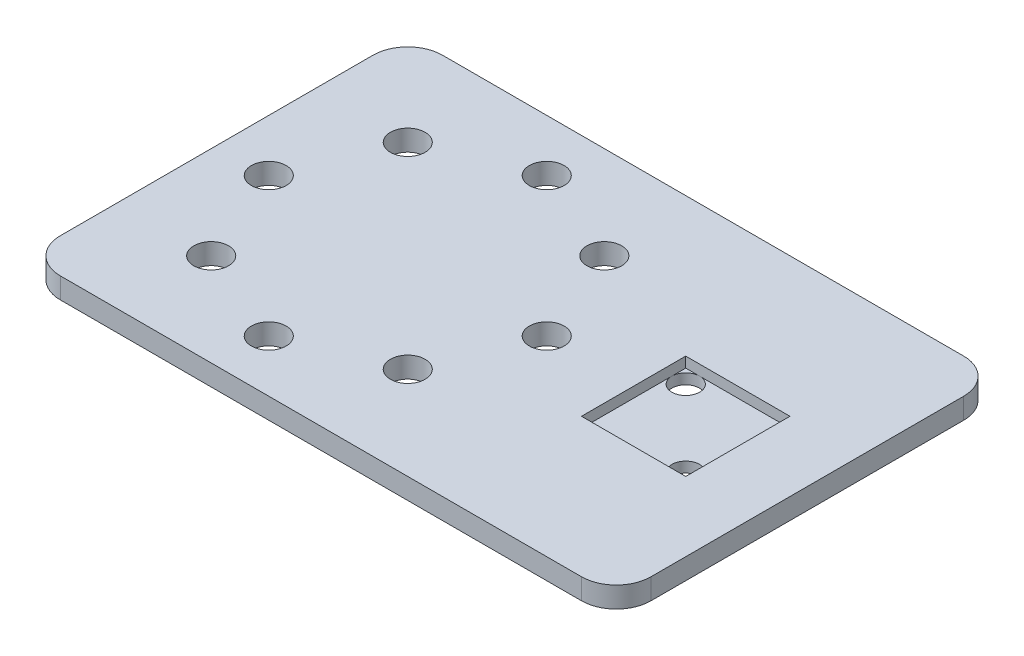
ISO-10303-21;
HEADER;
FILE_DESCRIPTION(('STEP AP214'),'2;1');
FILE_NAME('part.step','',(''),(''),'','','');
FILE_SCHEMA(('AUTOMOTIVE_DESIGN { 1 0 10303 214 1 1 1 1 }'));
ENDSEC;
DATA;
#1=APPLICATION_CONTEXT('core data for automotive mechanical design processes');
#2=APPLICATION_PROTOCOL_DEFINITION('international standard','automotive_design',2000,#1);
#3=PRODUCT_CONTEXT('',#1,'mechanical');
#4=PRODUCT('Part','Part','',(#3));
#5=PRODUCT_RELATED_PRODUCT_CATEGORY('part','',(#4));
#6=PRODUCT_DEFINITION_FORMATION('','',#4);
#7=PRODUCT_DEFINITION_CONTEXT('part definition',#1,'design');
#8=PRODUCT_DEFINITION('design','',#6,#7);
#9=PRODUCT_DEFINITION_SHAPE('','',#8);
#10=(LENGTH_UNIT() NAMED_UNIT(*) SI_UNIT(.MILLI.,.METRE.));
#11=(NAMED_UNIT(*) PLANE_ANGLE_UNIT() SI_UNIT($,.RADIAN.));
#12=(NAMED_UNIT(*) SI_UNIT($,.STERADIAN.) SOLID_ANGLE_UNIT());
#13=UNCERTAINTY_MEASURE_WITH_UNIT(LENGTH_MEASURE(1.E-05),#10,'distance_accuracy_value','');
#14=(GEOMETRIC_REPRESENTATION_CONTEXT(3) GLOBAL_UNCERTAINTY_ASSIGNED_CONTEXT((#13)) GLOBAL_UNIT_ASSIGNED_CONTEXT((#10,
#11,#12)) REPRESENTATION_CONTEXT('',''));
#15=CARTESIAN_POINT('',(0.,0.,0.));
#16=DIRECTION('',(0.,0.,1.));
#17=DIRECTION('',(1.,0.,0.));
#18=AXIS2_PLACEMENT_3D('',#15,#16,#17);
#19=CARTESIAN_POINT('',(42.502,1.5,-7.06673306772907));
#20=DIRECTION('',(0.,-1.,0.));
#21=DIRECTION('',(0.,0.,-1.));
#22=AXIS2_PLACEMENT_3D('',#19,#20,#21);
#23=PLANE('',#22);
#24=CARTESIAN_POINT('',(30.5,1.5,5.93326693227093));
#25=DIRECTION('',(0.,1.,0.));
#26=DIRECTION('',(0.,0.,1.));
#27=AXIS2_PLACEMENT_3D('',#24,#25,#26);
#28=CIRCLE('',#27,2.);
#29=CARTESIAN_POINT('',(30.5,1.5,7.93326693227093));
#30=VERTEX_POINT('',#29);
#31=CARTESIAN_POINT('',(32.5,1.5,5.93326693227093));
#32=VERTEX_POINT('',#31);
#33=EDGE_CURVE('E63',#30,#32,#28,.T.);
#34=ORIENTED_EDGE('',*,*,#33,.F.);
#35=DIRECTION('',(-1.,0.,0.));
#36=VECTOR('',#35,1.);
#37=CARTESIAN_POINT('',(42.502,1.5,7.93326693227093));
#38=LINE('',#37,#36);
#39=CARTESIAN_POINT('',(32.5,1.5,7.93326693227093));
#40=VERTEX_POINT('',#39);
#41=EDGE_CURVE('E175',#40,#30,#38,.T.);
#42=ORIENTED_EDGE('',*,*,#41,.F.);
#43=DIRECTION('',(0.,0.,-1.));
#44=VECTOR('',#43,1.);
#45=CARTESIAN_POINT('',(32.5,1.5,-7.06673306772907));
#46=LINE('',#45,#44);
#47=EDGE_CURVE('E166',#40,#32,#46,.T.);
#48=ORIENTED_EDGE('',*,*,#47,.T.);
#49=EDGE_LOOP('',(#34,#42,#48));
#50=FACE_BOUND('',#49,.T.);
#51=ADVANCED_FACE('F39',(#50),#23,.F.);
#52=CARTESIAN_POINT('',(19.5,1.5,-5.06673306772908));
#53=DIRECTION('',(0.,1.,0.));
#54=DIRECTION('',(0.,0.,1.));
#55=AXIS2_PLACEMENT_3D('',#52,#53,#54);
#56=CIRCLE('',#55,2.);
#57=CARTESIAN_POINT('',(19.5,1.5,-7.06673306772908));
#58=VERTEX_POINT('',#57);
#59=CARTESIAN_POINT('',(17.5,1.5,-5.06673306772908));
#60=VERTEX_POINT('',#59);
#61=EDGE_CURVE('E56',#58,#60,#56,.T.);
#62=ORIENTED_EDGE('',*,*,#61,.F.);
#63=DIRECTION('',(-1.,0.,0.));
#64=VECTOR('',#63,1.);
#65=CARTESIAN_POINT('',(42.502,1.5,-7.06673306772907));
#66=LINE('',#65,#64);
#67=CARTESIAN_POINT('',(17.5,1.5,-7.06673306772907));
#68=VERTEX_POINT('',#67);
#69=EDGE_CURVE('E152',#58,#68,#66,.T.);
#70=ORIENTED_EDGE('',*,*,#69,.T.);
#71=DIRECTION('',(0.,0.,1.));
#72=VECTOR('',#71,1.);
#73=CARTESIAN_POINT('',(17.5,1.5,-7.06673306772907));
#74=LINE('',#73,#72);
#75=EDGE_CURVE('E154',#68,#60,#74,.T.);
#76=ORIENTED_EDGE('',*,*,#75,.T.);
#77=EDGE_LOOP('',(#62,#70,#76));
#78=FACE_BOUND('',#77,.T.);
#79=ADVANCED_FACE('F151',(#78),#23,.F.);
#80=CARTESIAN_POINT('',(17.5,3.,7.93326693227093));
#81=DIRECTION('',(1.,0.,0.));
#82=DIRECTION('',(0.,0.,-1.));
#83=AXIS2_PLACEMENT_3D('',#80,#81,#82);
#84=PLANE('',#83);
#85=DIRECTION('',(0.,-1.,0.));
#86=VECTOR('',#85,1.);
#87=CARTESIAN_POINT('',(17.5,3.,7.93326693227093));
#88=LINE('',#87,#86);
#89=CARTESIAN_POINT('',(17.5,3.,7.93326693227093));
#90=VERTEX_POINT('',#89);
#91=CARTESIAN_POINT('',(17.5,1.5,7.93326693227093));
#92=VERTEX_POINT('',#91);
#93=EDGE_CURVE('E269',#90,#92,#88,.T.);
#94=ORIENTED_EDGE('',*,*,#93,.T.);
#95=EDGE_CURVE('E182',#60,#92,#74,.T.);
#96=ORIENTED_EDGE('',*,*,#95,.F.);
#97=ORIENTED_EDGE('',*,*,#75,.F.);
#98=DIRECTION('',(0.,-1.,0.));
#99=VECTOR('',#98,1.);
#100=CARTESIAN_POINT('',(17.5,3.,-7.06673306772907));
#101=LINE('',#100,#99);
#102=CARTESIAN_POINT('',(17.5,3.,-7.06673306772907));
#103=VERTEX_POINT('',#102);
#104=EDGE_CURVE('E164',#103,#68,#101,.T.);
#105=ORIENTED_EDGE('',*,*,#104,.F.);
#106=DIRECTION('',(0.,0.,1.));
#107=VECTOR('',#106,1.);
#108=CARTESIAN_POINT('',(17.5,3.,7.93326693227093));
#109=LINE('',#108,#107);
#110=EDGE_CURVE('E244',#103,#90,#109,.T.);
#111=ORIENTED_EDGE('',*,*,#110,.T.);
#112=EDGE_LOOP('',(#94,#96,#97,#105,#111));
#113=FACE_BOUND('',#112,.T.);
#114=ADVANCED_FACE('F381',(#113),#84,.T.);
#115=CARTESIAN_POINT('',(32.5,3.,7.93326693227092));
#116=DIRECTION('',(0.,0.,-1.));
#117=DIRECTION('',(-1.,0.,0.));
#118=AXIS2_PLACEMENT_3D('',#115,#116,#117);
#119=PLANE('',#118);
#120=DIRECTION('',(0.,-1.,0.));
#121=VECTOR('',#120,1.);
#122=CARTESIAN_POINT('',(32.5,3.,7.93326693227092));
#123=LINE('',#122,#121);
#124=CARTESIAN_POINT('',(32.5,3.,7.93326693227092));
#125=VERTEX_POINT('',#124);
#126=EDGE_CURVE('E265',#125,#40,#123,.T.);
#127=ORIENTED_EDGE('',*,*,#126,.T.);
#128=ORIENTED_EDGE('',*,*,#41,.T.);
#129=EDGE_CURVE('E172',#30,#92,#38,.T.);
#130=ORIENTED_EDGE('',*,*,#129,.T.);
#131=ORIENTED_EDGE('',*,*,#93,.F.);
#132=DIRECTION('',(1.,0.,0.));
#133=VECTOR('',#132,1.);
#134=CARTESIAN_POINT('',(32.5,3.,7.93326693227092));
#135=LINE('',#134,#133);
#136=EDGE_CURVE('E250',#90,#125,#135,.T.);
#137=ORIENTED_EDGE('',*,*,#136,.T.);
#138=EDGE_LOOP('',(#127,#128,#130,#131,#137));
#139=FACE_BOUND('',#138,.T.);
#140=ADVANCED_FACE('F372',(#139),#119,.T.);
#141=CARTESIAN_POINT('',(32.5,3.,7.93326693227092));
#142=DIRECTION('',(-1.,0.,0.));
#143=DIRECTION('',(0.,0.,1.));
#144=AXIS2_PLACEMENT_3D('',#141,#142,#143);
#145=PLANE('',#144);
#146=DIRECTION('',(0.,-1.,0.));
#147=VECTOR('',#146,1.);
#148=CARTESIAN_POINT('',(32.5,3.,-7.06673306772908));
#149=LINE('',#148,#147);
#150=CARTESIAN_POINT('',(32.5,3.,-7.06673306772908));
#151=VERTEX_POINT('',#150);
#152=CARTESIAN_POINT('',(32.5,1.5,-7.06673306772908));
#153=VERTEX_POINT('',#152);
#154=EDGE_CURVE('E262',#151,#153,#149,.T.);
#155=ORIENTED_EDGE('',*,*,#154,.T.);
#156=EDGE_CURVE('E170',#32,#153,#46,.T.);
#157=ORIENTED_EDGE('',*,*,#156,.F.);
#158=ORIENTED_EDGE('',*,*,#47,.F.);
#159=ORIENTED_EDGE('',*,*,#126,.F.);
#160=DIRECTION('',(0.,0.,-1.));
#161=VECTOR('',#160,1.);
#162=CARTESIAN_POINT('',(32.5,3.,7.93326693227092));
#163=LINE('',#162,#161);
#164=EDGE_CURVE('E253',#125,#151,#163,.T.);
#165=ORIENTED_EDGE('',*,*,#164,.T.);
#166=EDGE_LOOP('',(#155,#157,#158,#159,#165));
#167=FACE_BOUND('',#166,.T.);
#168=ADVANCED_FACE('F369',(#167),#145,.T.);
#169=CARTESIAN_POINT('',(32.5,3.,-7.06673306772908));
#170=DIRECTION('',(0.,0.,1.));
#171=DIRECTION('',(1.,0.,0.));
#172=AXIS2_PLACEMENT_3D('',#169,#170,#171);
#173=PLANE('',#172);
#174=ORIENTED_EDGE('',*,*,#104,.T.);
#175=ORIENTED_EDGE('',*,*,#69,.F.);
#176=EDGE_CURVE('E161',#153,#58,#66,.T.);
#177=ORIENTED_EDGE('',*,*,#176,.F.);
#178=ORIENTED_EDGE('',*,*,#154,.F.);
#179=DIRECTION('',(-1.,0.,0.));
#180=VECTOR('',#179,1.);
#181=CARTESIAN_POINT('',(32.5,3.,-7.06673306772908));
#182=LINE('',#181,#180);
#183=EDGE_CURVE('E257',#151,#103,#182,.T.);
#184=ORIENTED_EDGE('',*,*,#183,.T.);
#185=EDGE_LOOP('',(#174,#175,#177,#178,#184));
#186=FACE_BOUND('',#185,.T.);
#187=ADVANCED_FACE('F160',(#186),#173,.T.);
#188=CARTESIAN_POINT('',(0.,3.,0.));
#189=DIRECTION('',(0.,1.,0.));
#190=DIRECTION('',(0.,0.,1.));
#191=AXIS2_PLACEMENT_3D('',#188,#189,#190);
#192=PLANE('',#191);
#193=CARTESIAN_POINT('',(-15.0000000000002,3.,20.4332669322709));
#194=DIRECTION('',(0.,1.,0.));
#195=DIRECTION('',(0.,0.,1.));
#196=AXIS2_PLACEMENT_3D('',#193,#194,#195);
#197=CIRCLE('',#196,2.49999999999999);
#198=CARTESIAN_POINT('',(-15.0000000000002,3.,22.9332669322709));
#199=VERTEX_POINT('',#198);
#200=EDGE_CURVE('E192',#199,#199,#197,.T.);
#201=ORIENTED_EDGE('',*,*,#200,.F.);
#202=EDGE_LOOP('',(#201));
#203=FACE_BOUND('',#202,.T.);
#204=CARTESIAN_POINT('',(4.99999999999999,3.,0.433266932271059));
#205=DIRECTION('',(0.,1.,0.));
#206=DIRECTION('',(0.,0.,1.));
#207=AXIS2_PLACEMENT_3D('',#204,#205,#206);
#208=CIRCLE('',#207,2.49999999999999);
#209=CARTESIAN_POINT('',(4.99999999999999,3.,2.93326693227105));
#210=VERTEX_POINT('',#209);
#211=EDGE_CURVE('E208',#210,#210,#208,.T.);
#212=ORIENTED_EDGE('',*,*,#211,.F.);
#213=EDGE_LOOP('',(#212));
#214=FACE_BOUND('',#213,.T.);
#215=CARTESIAN_POINT('',(-14.9999999999999,3.,-19.5667330677291));
#216=DIRECTION('',(0.,1.,0.));
#217=DIRECTION('',(0.,0.,1.));
#218=AXIS2_PLACEMENT_3D('',#215,#216,#217);
#219=CIRCLE('',#218,2.49999999999999);
#220=CARTESIAN_POINT('',(-14.9999999999999,3.,-17.0667330677291));
#221=VERTEX_POINT('',#220);
#222=EDGE_CURVE('E224',#221,#221,#219,.T.);
#223=ORIENTED_EDGE('',*,*,#222,.F.);
#224=EDGE_LOOP('',(#223));
#225=FACE_BOUND('',#224,.T.);
#226=CARTESIAN_POINT('',(-35.,3.,0.433266932270919));
#227=DIRECTION('',(0.,1.,0.));
#228=DIRECTION('',(0.,0.,1.));
#229=AXIS2_PLACEMENT_3D('',#226,#227,#228);
#230=CIRCLE('',#229,2.49999999999999);
#231=CARTESIAN_POINT('',(-35.,3.,2.93326693227091));
#232=VERTEX_POINT('',#231);
#233=EDGE_CURVE('E240',#232,#232,#230,.T.);
#234=ORIENTED_EDGE('',*,*,#233,.F.);
#235=EDGE_LOOP('',(#234));
#236=FACE_BOUND('',#235,.T.);
#237=DIRECTION('',(0.,0.,-1.));
#238=VECTOR('',#237,1.);
#239=CARTESIAN_POINT('',(42.5,3.,27.9332669322709));
#240=LINE('',#239,#238);
#241=CARTESIAN_POINT('',(42.5,3.,22.9332669322709));
#242=VERTEX_POINT('',#241);
#243=CARTESIAN_POINT('',(42.5,3.,-22.0667330677291));
#244=VERTEX_POINT('',#243);
#245=EDGE_CURVE('E274',#242,#244,#240,.T.);
#246=ORIENTED_EDGE('',*,*,#245,.T.);
#247=CARTESIAN_POINT('',(37.5,3.,-22.0667330677291));
#248=DIRECTION('',(0.,1.,0.));
#249=DIRECTION('',(0.,0.,1.));
#250=AXIS2_PLACEMENT_3D('',#247,#248,#249);
#251=CIRCLE('',#250,5.);
#252=CARTESIAN_POINT('',(37.5,3.,-27.0667330677291));
#253=VERTEX_POINT('',#252);
#254=EDGE_CURVE('E340',#244,#253,#251,.T.);
#255=ORIENTED_EDGE('',*,*,#254,.T.);
#256=DIRECTION('',(-1.,0.,0.));
#257=VECTOR('',#256,1.);
#258=CARTESIAN_POINT('',(42.5,3.,-27.0667330677291));
#259=LINE('',#258,#257);
#260=CARTESIAN_POINT('',(-37.5,3.,-27.0667330677291));
#261=VERTEX_POINT('',#260);
#262=EDGE_CURVE('E278',#253,#261,#259,.T.);
#263=ORIENTED_EDGE('',*,*,#262,.T.);
#264=CARTESIAN_POINT('',(-37.5,3.,-22.0667330677291));
#265=DIRECTION('',(0.,1.,0.));
#266=DIRECTION('',(0.,0.,1.));
#267=AXIS2_PLACEMENT_3D('',#264,#265,#266);
#268=CIRCLE('',#267,5.);
#269=CARTESIAN_POINT('',(-42.5,3.,-22.0667330677291));
#270=VERTEX_POINT('',#269);
#271=EDGE_CURVE('E337',#261,#270,#268,.T.);
#272=ORIENTED_EDGE('',*,*,#271,.T.);
#273=DIRECTION('',(0.,0.,1.));
#274=VECTOR('',#273,1.);
#275=CARTESIAN_POINT('',(-42.5,3.,27.9332669322709));
#276=LINE('',#275,#274);
#277=CARTESIAN_POINT('',(-42.5,3.,22.9332669322709));
#278=VERTEX_POINT('',#277);
#279=EDGE_CURVE('E283',#270,#278,#276,.T.);
#280=ORIENTED_EDGE('',*,*,#279,.T.);
#281=CARTESIAN_POINT('',(-37.5,3.,22.9332669322709));
#282=DIRECTION('',(0.,1.,0.));
#283=DIRECTION('',(0.,0.,1.));
#284=AXIS2_PLACEMENT_3D('',#281,#282,#283);
#285=CIRCLE('',#284,5.);
#286=CARTESIAN_POINT('',(-37.5,3.,27.9332669322709));
#287=VERTEX_POINT('',#286);
#288=EDGE_CURVE('E334',#278,#287,#285,.T.);
#289=ORIENTED_EDGE('',*,*,#288,.T.);
#290=DIRECTION('',(1.,0.,0.));
#291=VECTOR('',#290,1.);
#292=CARTESIAN_POINT('',(42.5,3.,27.9332669322709));
#293=LINE('',#292,#291);
#294=CARTESIAN_POINT('',(37.5,3.,27.9332669322709));
#295=VERTEX_POINT('',#294);
#296=EDGE_CURVE('E287',#287,#295,#293,.T.);
#297=ORIENTED_EDGE('',*,*,#296,.T.);
#298=CARTESIAN_POINT('',(37.5,3.,22.9332669322709));
#299=DIRECTION('',(0.,1.,0.));
#300=DIRECTION('',(0.,0.,1.));
#301=AXIS2_PLACEMENT_3D('',#298,#299,#300);
#302=CIRCLE('',#301,5.);
#303=EDGE_CURVE('E331',#295,#242,#302,.T.);
#304=ORIENTED_EDGE('',*,*,#303,.T.);
#305=EDGE_LOOP('',(#246,#255,#263,#272,#280,#289,#297,#304));
#306=FACE_BOUND('',#305,.T.);
#307=ORIENTED_EDGE('',*,*,#136,.F.);
#308=ORIENTED_EDGE('',*,*,#110,.F.);
#309=ORIENTED_EDGE('',*,*,#183,.F.);
#310=ORIENTED_EDGE('',*,*,#164,.F.);
#311=EDGE_LOOP('',(#307,#308,#309,#310));
#312=FACE_BOUND('',#311,.T.);
#313=CARTESIAN_POINT('',(-29.1421356237309,3.,-13.7088686914601));
#314=DIRECTION('',(0.,1.,0.));
#315=DIRECTION('',(0.,0.,1.));
#316=AXIS2_PLACEMENT_3D('',#313,#314,#315);
#317=CIRCLE('',#316,2.5);
#318=CARTESIAN_POINT('',(-29.1421356237309,3.,-11.2088686914601));
#319=VERTEX_POINT('',#318);
#320=EDGE_CURVE('E232',#319,#319,#317,.T.);
#321=ORIENTED_EDGE('',*,*,#320,.F.);
#322=EDGE_LOOP('',(#321));
#323=FACE_BOUND('',#322,.T.);
#324=CARTESIAN_POINT('',(-0.857864376268978,3.,-13.7088686914599));
#325=DIRECTION('',(0.,1.,0.));
#326=DIRECTION('',(0.,0.,1.));
#327=AXIS2_PLACEMENT_3D('',#324,#325,#326);
#328=CIRCLE('',#327,2.49999999999999);
#329=CARTESIAN_POINT('',(-0.857864376268978,3.,-11.20886869146));
#330=VERTEX_POINT('',#329);
#331=EDGE_CURVE('E216',#330,#330,#328,.T.);
#332=ORIENTED_EDGE('',*,*,#331,.F.);
#333=EDGE_LOOP('',(#332));
#334=FACE_BOUND('',#333,.T.);
#335=CARTESIAN_POINT('',(-0.857864376269179,3.,14.575402556002));
#336=DIRECTION('',(0.,1.,0.));
#337=DIRECTION('',(0.,0.,1.));
#338=AXIS2_PLACEMENT_3D('',#335,#336,#337);
#339=CIRCLE('',#338,2.49999999999999);
#340=CARTESIAN_POINT('',(-0.857864376269179,3.,17.075402556002));
#341=VERTEX_POINT('',#340);
#342=EDGE_CURVE('E200',#341,#341,#339,.T.);
#343=ORIENTED_EDGE('',*,*,#342,.F.);
#344=EDGE_LOOP('',(#343));
#345=FACE_BOUND('',#344,.T.);
#346=CARTESIAN_POINT('',(-29.1421356237311,3.,14.5754025560017));
#347=DIRECTION('',(0.,1.,0.));
#348=DIRECTION('',(0.,0.,1.));
#349=AXIS2_PLACEMENT_3D('',#346,#347,#348);
#350=CIRCLE('',#349,2.5);
#351=CARTESIAN_POINT('',(-29.1421356237311,3.,17.0754025560017));
#352=VERTEX_POINT('',#351);
#353=EDGE_CURVE('E183',#352,#352,#350,.T.);
#354=ORIENTED_EDGE('',*,*,#353,.F.);
#355=EDGE_LOOP('',(#354));
#356=FACE_BOUND('',#355,.T.);
#357=ADVANCED_FACE('F377',(#203,#214,#225,#236,#306,#312,#323,#334,#345,#356),#192,.T.);
#358=CARTESIAN_POINT('',(0.,0.,0.));
#359=DIRECTION('',(0.,1.,0.));
#360=DIRECTION('',(0.,0.,1.));
#361=AXIS2_PLACEMENT_3D('',#358,#359,#360);
#362=PLANE('',#361);
#363=CARTESIAN_POINT('',(30.5,0.,5.93326693227093));
#364=DIRECTION('',(0.,1.,0.));
#365=DIRECTION('',(0.,0.,1.));
#366=AXIS2_PLACEMENT_3D('',#363,#364,#365);
#367=CIRCLE('',#366,2.);
#368=CARTESIAN_POINT('',(30.5,0.,7.93326693227093));
#369=VERTEX_POINT('',#368);
#370=EDGE_CURVE('E43',#369,#369,#367,.T.);
#371=ORIENTED_EDGE('',*,*,#370,.T.);
#372=EDGE_LOOP('',(#371));
#373=FACE_BOUND('',#372,.T.);
#374=CARTESIAN_POINT('',(19.5,0.,-5.06673306772908));
#375=DIRECTION('',(0.,1.,0.));
#376=DIRECTION('',(0.,0.,1.));
#377=AXIS2_PLACEMENT_3D('',#374,#375,#376);
#378=CIRCLE('',#377,2.);
#379=CARTESIAN_POINT('',(19.5,0.,-3.06673306772907));
#380=VERTEX_POINT('',#379);
#381=EDGE_CURVE('E351',#380,#380,#378,.T.);
#382=ORIENTED_EDGE('',*,*,#381,.T.);
#383=EDGE_LOOP('',(#382));
#384=FACE_BOUND('',#383,.T.);
#385=DIRECTION('',(-1.,0.,0.));
#386=VECTOR('',#385,1.);
#387=CARTESIAN_POINT('',(42.5,0.,-27.0667330677291));
#388=LINE('',#387,#386);
#389=CARTESIAN_POINT('',(37.5,0.,-27.0667330677291));
#390=VERTEX_POINT('',#389);
#391=CARTESIAN_POINT('',(-37.5,0.,-27.0667330677291));
#392=VERTEX_POINT('',#391);
#393=EDGE_CURVE('E295',#390,#392,#388,.T.);
#394=ORIENTED_EDGE('',*,*,#393,.F.);
#395=CARTESIAN_POINT('',(37.5,0.,-22.0667330677291));
#396=DIRECTION('',(0.,1.,0.));
#397=DIRECTION('',(0.,0.,1.));
#398=AXIS2_PLACEMENT_3D('',#395,#396,#397);
#399=CIRCLE('',#398,5.);
#400=CARTESIAN_POINT('',(42.5,0.,-22.0667330677291));
#401=VERTEX_POINT('',#400);
#402=EDGE_CURVE('E321',#390,#401,#399,.F.);
#403=ORIENTED_EDGE('',*,*,#402,.T.);
#404=DIRECTION('',(0.,0.,-1.));
#405=VECTOR('',#404,1.);
#406=CARTESIAN_POINT('',(42.5,0.,27.9332669322709));
#407=LINE('',#406,#405);
#408=CARTESIAN_POINT('',(42.5,0.,22.9332669322709));
#409=VERTEX_POINT('',#408);
#410=EDGE_CURVE('E273',#409,#401,#407,.T.);
#411=ORIENTED_EDGE('',*,*,#410,.F.);
#412=CARTESIAN_POINT('',(37.5,0.,22.9332669322709));
#413=DIRECTION('',(0.,1.,0.));
#414=DIRECTION('',(0.,0.,1.));
#415=AXIS2_PLACEMENT_3D('',#412,#413,#414);
#416=CIRCLE('',#415,5.);
#417=CARTESIAN_POINT('',(37.5,0.,27.9332669322709));
#418=VERTEX_POINT('',#417);
#419=EDGE_CURVE('E312',#409,#418,#416,.F.);
#420=ORIENTED_EDGE('',*,*,#419,.T.);
#421=DIRECTION('',(1.,0.,0.));
#422=VECTOR('',#421,1.);
#423=CARTESIAN_POINT('',(42.5,0.,27.9332669322709));
#424=LINE('',#423,#422);
#425=CARTESIAN_POINT('',(-37.5,0.,27.9332669322709));
#426=VERTEX_POINT('',#425);
#427=EDGE_CURVE('E279',#426,#418,#424,.T.);
#428=ORIENTED_EDGE('',*,*,#427,.F.);
#429=CARTESIAN_POINT('',(-37.5,0.,22.9332669322709));
#430=DIRECTION('',(0.,1.,0.));
#431=DIRECTION('',(0.,0.,1.));
#432=AXIS2_PLACEMENT_3D('',#429,#430,#431);
#433=CIRCLE('',#432,5.);
#434=CARTESIAN_POINT('',(-42.5,0.,22.9332669322709));
#435=VERTEX_POINT('',#434);
#436=EDGE_CURVE('E315',#426,#435,#433,.F.);
#437=ORIENTED_EDGE('',*,*,#436,.T.);
#438=DIRECTION('',(0.,0.,1.));
#439=VECTOR('',#438,1.);
#440=CARTESIAN_POINT('',(-42.5,0.,27.9332669322709));
#441=LINE('',#440,#439);
#442=CARTESIAN_POINT('',(-42.5,0.,-22.0667330677291));
#443=VERTEX_POINT('',#442);
#444=EDGE_CURVE('E299',#443,#435,#441,.T.);
#445=ORIENTED_EDGE('',*,*,#444,.F.);
#446=CARTESIAN_POINT('',(-37.5,0.,-22.0667330677291));
#447=DIRECTION('',(0.,1.,0.));
#448=DIRECTION('',(0.,0.,1.));
#449=AXIS2_PLACEMENT_3D('',#446,#447,#448);
#450=CIRCLE('',#449,5.);
#451=EDGE_CURVE('E318',#443,#392,#450,.F.);
#452=ORIENTED_EDGE('',*,*,#451,.T.);
#453=EDGE_LOOP('',(#394,#403,#411,#420,#428,#437,#445,#452));
#454=FACE_BOUND('',#453,.T.);
#455=CARTESIAN_POINT('',(-35.,0.,0.433266932270919));
#456=DIRECTION('',(0.,1.,0.));
#457=DIRECTION('',(0.,0.,1.));
#458=AXIS2_PLACEMENT_3D('',#455,#456,#457);
#459=CIRCLE('',#458,2.49999999999999);
#460=CARTESIAN_POINT('',(-35.,0.,2.93326693227091));
#461=VERTEX_POINT('',#460);
#462=EDGE_CURVE('E236',#461,#461,#459,.T.);
#463=ORIENTED_EDGE('',*,*,#462,.T.);
#464=EDGE_LOOP('',(#463));
#465=FACE_BOUND('',#464,.T.);
#466=CARTESIAN_POINT('',(-29.1421356237309,0.,-13.7088686914601));
#467=DIRECTION('',(0.,1.,0.));
#468=DIRECTION('',(0.,0.,1.));
#469=AXIS2_PLACEMENT_3D('',#466,#467,#468);
#470=CIRCLE('',#469,2.5);
#471=CARTESIAN_POINT('',(-29.1421356237309,0.,-11.2088686914601));
#472=VERTEX_POINT('',#471);
#473=EDGE_CURVE('E228',#472,#472,#470,.T.);
#474=ORIENTED_EDGE('',*,*,#473,.T.);
#475=EDGE_LOOP('',(#474));
#476=FACE_BOUND('',#475,.T.);
#477=CARTESIAN_POINT('',(-14.9999999999999,0.,-19.5667330677291));
#478=DIRECTION('',(0.,1.,0.));
#479=DIRECTION('',(0.,0.,1.));
#480=AXIS2_PLACEMENT_3D('',#477,#478,#479);
#481=CIRCLE('',#480,2.49999999999999);
#482=CARTESIAN_POINT('',(-14.9999999999999,0.,-17.0667330677291));
#483=VERTEX_POINT('',#482);
#484=EDGE_CURVE('E220',#483,#483,#481,.T.);
#485=ORIENTED_EDGE('',*,*,#484,.T.);
#486=EDGE_LOOP('',(#485));
#487=FACE_BOUND('',#486,.T.);
#488=CARTESIAN_POINT('',(-0.857864376268978,0.,-13.7088686914599));
#489=DIRECTION('',(0.,1.,0.));
#490=DIRECTION('',(0.,0.,1.));
#491=AXIS2_PLACEMENT_3D('',#488,#489,#490);
#492=CIRCLE('',#491,2.49999999999999);
#493=CARTESIAN_POINT('',(-0.857864376268978,0.,-11.20886869146));
#494=VERTEX_POINT('',#493);
#495=EDGE_CURVE('E212',#494,#494,#492,.T.);
#496=ORIENTED_EDGE('',*,*,#495,.T.);
#497=EDGE_LOOP('',(#496));
#498=FACE_BOUND('',#497,.T.);
#499=CARTESIAN_POINT('',(4.99999999999999,0.,0.433266932271059));
#500=DIRECTION('',(0.,1.,0.));
#501=DIRECTION('',(0.,0.,1.));
#502=AXIS2_PLACEMENT_3D('',#499,#500,#501);
#503=CIRCLE('',#502,2.49999999999999);
#504=CARTESIAN_POINT('',(4.99999999999999,0.,2.93326693227105));
#505=VERTEX_POINT('',#504);
#506=EDGE_CURVE('E204',#505,#505,#503,.T.);
#507=ORIENTED_EDGE('',*,*,#506,.T.);
#508=EDGE_LOOP('',(#507));
#509=FACE_BOUND('',#508,.T.);
#510=CARTESIAN_POINT('',(-0.857864376269179,0.,14.575402556002));
#511=DIRECTION('',(0.,1.,0.));
#512=DIRECTION('',(0.,0.,1.));
#513=AXIS2_PLACEMENT_3D('',#510,#511,#512);
#514=CIRCLE('',#513,2.49999999999999);
#515=CARTESIAN_POINT('',(-0.857864376269179,0.,17.075402556002));
#516=VERTEX_POINT('',#515);
#517=EDGE_CURVE('E196',#516,#516,#514,.T.);
#518=ORIENTED_EDGE('',*,*,#517,.T.);
#519=EDGE_LOOP('',(#518));
#520=FACE_BOUND('',#519,.T.);
#521=CARTESIAN_POINT('',(-15.0000000000002,0.,20.4332669322709));
#522=DIRECTION('',(0.,1.,0.));
#523=DIRECTION('',(0.,0.,1.));
#524=AXIS2_PLACEMENT_3D('',#521,#522,#523);
#525=CIRCLE('',#524,2.49999999999999);
#526=CARTESIAN_POINT('',(-15.0000000000002,0.,22.9332669322709));
#527=VERTEX_POINT('',#526);
#528=EDGE_CURVE('E187',#527,#527,#525,.T.);
#529=ORIENTED_EDGE('',*,*,#528,.T.);
#530=EDGE_LOOP('',(#529));
#531=FACE_BOUND('',#530,.T.);
#532=CARTESIAN_POINT('',(-29.1421356237311,0.,14.5754025560017));
#533=DIRECTION('',(0.,1.,0.));
#534=DIRECTION('',(0.,0.,1.));
#535=AXIS2_PLACEMENT_3D('',#532,#533,#534);
#536=CIRCLE('',#535,2.5);
#537=CARTESIAN_POINT('',(-29.1421356237311,0.,17.0754025560017));
#538=VERTEX_POINT('',#537);
#539=EDGE_CURVE('E188',#538,#538,#536,.T.);
#540=ORIENTED_EDGE('',*,*,#539,.T.);
#541=EDGE_LOOP('',(#540));
#542=FACE_BOUND('',#541,.T.);
#543=ADVANCED_FACE('F390',(#373,#384,#454,#465,#476,#487,#498,#509,#520,#531,#542),#362,.F.);
#544=CARTESIAN_POINT('',(42.5,3.,27.9332669322709));
#545=DIRECTION('',(-1.,0.,0.));
#546=DIRECTION('',(0.,0.,1.));
#547=AXIS2_PLACEMENT_3D('',#544,#545,#546);
#548=PLANE('',#547);
#549=ORIENTED_EDGE('',*,*,#410,.T.);
#550=DIRECTION('',(0.,-1.,0.));
#551=VECTOR('',#550,1.);
#552=CARTESIAN_POINT('',(42.5,3.,-22.0667330677291));
#553=LINE('',#552,#551);
#554=EDGE_CURVE('E328',#401,#244,#553,.F.);
#555=ORIENTED_EDGE('',*,*,#554,.T.);
#556=ORIENTED_EDGE('',*,*,#245,.F.);
#557=DIRECTION('',(0.,-1.,0.));
#558=VECTOR('',#557,1.);
#559=CARTESIAN_POINT('',(42.5,3.,22.9332669322709));
#560=LINE('',#559,#558);
#561=EDGE_CURVE('E324',#242,#409,#560,.T.);
#562=ORIENTED_EDGE('',*,*,#561,.T.);
#563=EDGE_LOOP('',(#549,#555,#556,#562));
#564=FACE_BOUND('',#563,.T.);
#565=ADVANCED_FACE('F392',(#564),#548,.F.);
#566=CARTESIAN_POINT('',(42.5,3.,-27.0667330677291));
#567=DIRECTION('',(0.,0.,1.));
#568=DIRECTION('',(1.,0.,0.));
#569=AXIS2_PLACEMENT_3D('',#566,#567,#568);
#570=PLANE('',#569);
#571=ORIENTED_EDGE('',*,*,#262,.F.);
#572=DIRECTION('',(0.,-1.,0.));
#573=VECTOR('',#572,1.);
#574=CARTESIAN_POINT('',(37.5,3.,-27.0667330677291));
#575=LINE('',#574,#573);
#576=EDGE_CURVE('E308',#253,#390,#575,.T.);
#577=ORIENTED_EDGE('',*,*,#576,.T.);
#578=ORIENTED_EDGE('',*,*,#393,.T.);
#579=DIRECTION('',(0.,-1.,0.));
#580=VECTOR('',#579,1.);
#581=CARTESIAN_POINT('',(-37.5,3.,-27.0667330677291));
#582=LINE('',#581,#580);
#583=EDGE_CURVE('E291',#392,#261,#582,.F.);
#584=ORIENTED_EDGE('',*,*,#583,.T.);
#585=EDGE_LOOP('',(#571,#577,#578,#584));
#586=FACE_BOUND('',#585,.T.);
#587=ADVANCED_FACE('F460',(#586),#570,.F.);
#588=CARTESIAN_POINT('',(-42.5,3.,27.9332669322709));
#589=DIRECTION('',(1.,0.,0.));
#590=DIRECTION('',(0.,0.,-1.));
#591=AXIS2_PLACEMENT_3D('',#588,#589,#590);
#592=PLANE('',#591);
#593=ORIENTED_EDGE('',*,*,#279,.F.);
#594=DIRECTION('',(0.,-1.,0.));
#595=VECTOR('',#594,1.);
#596=CARTESIAN_POINT('',(-42.5,3.,-22.0667330677291));
#597=LINE('',#596,#595);
#598=EDGE_CURVE('E346',#270,#443,#597,.T.);
#599=ORIENTED_EDGE('',*,*,#598,.T.);
#600=ORIENTED_EDGE('',*,*,#444,.T.);
#601=DIRECTION('',(0.,-1.,0.));
#602=VECTOR('',#601,1.);
#603=CARTESIAN_POINT('',(-42.5,3.,22.9332669322709));
#604=LINE('',#603,#602);
#605=EDGE_CURVE('E343',#435,#278,#604,.F.);
#606=ORIENTED_EDGE('',*,*,#605,.T.);
#607=EDGE_LOOP('',(#593,#599,#600,#606));
#608=FACE_BOUND('',#607,.T.);
#609=ADVANCED_FACE('F467',(#608),#592,.F.);
#610=CARTESIAN_POINT('',(42.5,3.,27.9332669322709));
#611=DIRECTION('',(0.,0.,-1.));
#612=DIRECTION('',(-1.,0.,0.));
#613=AXIS2_PLACEMENT_3D('',#610,#611,#612);
#614=PLANE('',#613);
#615=ORIENTED_EDGE('',*,*,#296,.F.);
#616=DIRECTION('',(0.,-1.,0.));
#617=VECTOR('',#616,1.);
#618=CARTESIAN_POINT('',(-37.5,3.,27.9332669322709));
#619=LINE('',#618,#617);
#620=EDGE_CURVE('E11',#287,#426,#619,.T.);
#621=ORIENTED_EDGE('',*,*,#620,.T.);
#622=ORIENTED_EDGE('',*,*,#427,.T.);
#623=DIRECTION('',(0.,-1.,0.));
#624=VECTOR('',#623,1.);
#625=CARTESIAN_POINT('',(37.5,3.,27.9332669322709));
#626=LINE('',#625,#624);
#627=EDGE_CURVE('E49',#418,#295,#626,.F.);
#628=ORIENTED_EDGE('',*,*,#627,.T.);
#629=EDGE_LOOP('',(#615,#621,#622,#628));
#630=FACE_BOUND('',#629,.T.);
#631=ADVANCED_FACE('F472',(#630),#614,.F.);
#632=CARTESIAN_POINT('',(-35.,3.,0.433266932270919));
#633=DIRECTION('',(0.,-1.,0.));
#634=DIRECTION('',(0.,0.,-1.));
#635=AXIS2_PLACEMENT_3D('',#632,#633,#634);
#636=CYLINDRICAL_SURFACE('',#635,2.49999999999999);
#637=ORIENTED_EDGE('',*,*,#233,.T.);
#638=EDGE_LOOP('',(#637));
#639=FACE_BOUND('',#638,.T.);
#640=ORIENTED_EDGE('',*,*,#462,.F.);
#641=EDGE_LOOP('',(#640));
#642=FACE_BOUND('',#641,.T.);
#643=ADVANCED_FACE('F475',(#639,#642),#636,.F.);
#644=CARTESIAN_POINT('',(-29.1421356237309,3.,-13.7088686914601));
#645=DIRECTION('',(0.,-1.,0.));
#646=DIRECTION('',(0.,0.,-1.));
#647=AXIS2_PLACEMENT_3D('',#644,#645,#646);
#648=CYLINDRICAL_SURFACE('',#647,2.5);
#649=ORIENTED_EDGE('',*,*,#320,.T.);
#650=EDGE_LOOP('',(#649));
#651=FACE_BOUND('',#650,.T.);
#652=ORIENTED_EDGE('',*,*,#473,.F.);
#653=EDGE_LOOP('',(#652));
#654=FACE_BOUND('',#653,.T.);
#655=ADVANCED_FACE('F481',(#651,#654),#648,.F.);
#656=CARTESIAN_POINT('',(-14.9999999999999,3.,-19.5667330677291));
#657=DIRECTION('',(0.,-1.,0.));
#658=DIRECTION('',(0.,0.,-1.));
#659=AXIS2_PLACEMENT_3D('',#656,#657,#658);
#660=CYLINDRICAL_SURFACE('',#659,2.49999999999999);
#661=ORIENTED_EDGE('',*,*,#222,.T.);
#662=EDGE_LOOP('',(#661));
#663=FACE_BOUND('',#662,.T.);
#664=ORIENTED_EDGE('',*,*,#484,.F.);
#665=EDGE_LOOP('',(#664));
#666=FACE_BOUND('',#665,.T.);
#667=ADVANCED_FACE('F634',(#663,#666),#660,.F.);
#668=CARTESIAN_POINT('',(-0.857864376268978,3.,-13.7088686914599));
#669=DIRECTION('',(0.,-1.,0.));
#670=DIRECTION('',(0.,0.,-1.));
#671=AXIS2_PLACEMENT_3D('',#668,#669,#670);
#672=CYLINDRICAL_SURFACE('',#671,2.49999999999999);
#673=ORIENTED_EDGE('',*,*,#331,.T.);
#674=EDGE_LOOP('',(#673));
#675=FACE_BOUND('',#674,.T.);
#676=ORIENTED_EDGE('',*,*,#495,.F.);
#677=EDGE_LOOP('',(#676));
#678=FACE_BOUND('',#677,.T.);
#679=ADVANCED_FACE('F625',(#675,#678),#672,.F.);
#680=CARTESIAN_POINT('',(4.99999999999999,3.,0.433266932271059));
#681=DIRECTION('',(0.,-1.,0.));
#682=DIRECTION('',(0.,0.,-1.));
#683=AXIS2_PLACEMENT_3D('',#680,#681,#682);
#684=CYLINDRICAL_SURFACE('',#683,2.49999999999999);
#685=ORIENTED_EDGE('',*,*,#211,.T.);
#686=EDGE_LOOP('',(#685));
#687=FACE_BOUND('',#686,.T.);
#688=ORIENTED_EDGE('',*,*,#506,.F.);
#689=EDGE_LOOP('',(#688));
#690=FACE_BOUND('',#689,.T.);
#691=ADVANCED_FACE('F616',(#687,#690),#684,.F.);
#692=CARTESIAN_POINT('',(-0.857864376269179,3.,14.575402556002));
#693=DIRECTION('',(0.,-1.,0.));
#694=DIRECTION('',(0.,0.,-1.));
#695=AXIS2_PLACEMENT_3D('',#692,#693,#694);
#696=CYLINDRICAL_SURFACE('',#695,2.49999999999999);
#697=ORIENTED_EDGE('',*,*,#342,.T.);
#698=EDGE_LOOP('',(#697));
#699=FACE_BOUND('',#698,.T.);
#700=ORIENTED_EDGE('',*,*,#517,.F.);
#701=EDGE_LOOP('',(#700));
#702=FACE_BOUND('',#701,.T.);
#703=ADVANCED_FACE('F426',(#699,#702),#696,.F.);
#704=CARTESIAN_POINT('',(-15.0000000000002,3.,20.4332669322709));
#705=DIRECTION('',(0.,-1.,0.));
#706=DIRECTION('',(0.,0.,-1.));
#707=AXIS2_PLACEMENT_3D('',#704,#705,#706);
#708=CYLINDRICAL_SURFACE('',#707,2.49999999999999);
#709=ORIENTED_EDGE('',*,*,#200,.T.);
#710=EDGE_LOOP('',(#709));
#711=FACE_BOUND('',#710,.T.);
#712=ORIENTED_EDGE('',*,*,#528,.F.);
#713=EDGE_LOOP('',(#712));
#714=FACE_BOUND('',#713,.T.);
#715=ADVANCED_FACE('F416',(#711,#714),#708,.F.);
#716=CARTESIAN_POINT('',(-29.1421356237311,3.,14.5754025560017));
#717=DIRECTION('',(0.,-1.,0.));
#718=DIRECTION('',(0.,0.,-1.));
#719=AXIS2_PLACEMENT_3D('',#716,#717,#718);
#720=CYLINDRICAL_SURFACE('',#719,2.5);
#721=ORIENTED_EDGE('',*,*,#353,.T.);
#722=EDGE_LOOP('',(#721));
#723=FACE_BOUND('',#722,.T.);
#724=ORIENTED_EDGE('',*,*,#539,.F.);
#725=EDGE_LOOP('',(#724));
#726=FACE_BOUND('',#725,.T.);
#727=ADVANCED_FACE('F413',(#723,#726),#720,.F.);
#728=CARTESIAN_POINT('',(37.5,3.,-22.0667330677291));
#729=DIRECTION('',(0.,-1.,0.));
#730=DIRECTION('',(0.,0.,-1.));
#731=AXIS2_PLACEMENT_3D('',#728,#729,#730);
#732=CYLINDRICAL_SURFACE('',#731,5.);
#733=ORIENTED_EDGE('',*,*,#254,.F.);
#734=ORIENTED_EDGE('',*,*,#554,.F.);
#735=ORIENTED_EDGE('',*,*,#402,.F.);
#736=ORIENTED_EDGE('',*,*,#576,.F.);
#737=EDGE_LOOP('',(#733,#734,#735,#736));
#738=FACE_BOUND('',#737,.T.);
#739=ADVANCED_FACE('F415',(#738),#732,.T.);
#740=CARTESIAN_POINT('',(-37.5,3.,-22.0667330677291));
#741=DIRECTION('',(0.,-1.,0.));
#742=DIRECTION('',(0.,0.,-1.));
#743=AXIS2_PLACEMENT_3D('',#740,#741,#742);
#744=CYLINDRICAL_SURFACE('',#743,5.);
#745=ORIENTED_EDGE('',*,*,#271,.F.);
#746=ORIENTED_EDGE('',*,*,#583,.F.);
#747=ORIENTED_EDGE('',*,*,#451,.F.);
#748=ORIENTED_EDGE('',*,*,#598,.F.);
#749=EDGE_LOOP('',(#745,#746,#747,#748));
#750=FACE_BOUND('',#749,.T.);
#751=ADVANCED_FACE('F423',(#750),#744,.T.);
#752=CARTESIAN_POINT('',(-37.5,3.,22.9332669322709));
#753=DIRECTION('',(0.,-1.,0.));
#754=DIRECTION('',(0.,0.,-1.));
#755=AXIS2_PLACEMENT_3D('',#752,#753,#754);
#756=CYLINDRICAL_SURFACE('',#755,5.);
#757=ORIENTED_EDGE('',*,*,#288,.F.);
#758=ORIENTED_EDGE('',*,*,#605,.F.);
#759=ORIENTED_EDGE('',*,*,#436,.F.);
#760=ORIENTED_EDGE('',*,*,#620,.F.);
#761=EDGE_LOOP('',(#757,#758,#759,#760));
#762=FACE_BOUND('',#761,.T.);
#763=ADVANCED_FACE('F440',(#762),#756,.T.);
#764=CARTESIAN_POINT('',(37.5,3.,22.9332669322709));
#765=DIRECTION('',(0.,-1.,0.));
#766=DIRECTION('',(0.,0.,-1.));
#767=AXIS2_PLACEMENT_3D('',#764,#765,#766);
#768=CYLINDRICAL_SURFACE('',#767,5.);
#769=ORIENTED_EDGE('',*,*,#303,.F.);
#770=ORIENTED_EDGE('',*,*,#627,.F.);
#771=ORIENTED_EDGE('',*,*,#419,.F.);
#772=ORIENTED_EDGE('',*,*,#561,.F.);
#773=EDGE_LOOP('',(#769,#770,#771,#772));
#774=FACE_BOUND('',#773,.T.);
#775=ADVANCED_FACE('F41',(#774),#768,.T.);
#776=EDGE_CURVE('E156',#32,#30,#28,.T.);
#777=ORIENTED_EDGE('',*,*,#776,.F.);
#778=ORIENTED_EDGE('',*,*,#156,.T.);
#779=ORIENTED_EDGE('',*,*,#176,.T.);
#780=EDGE_CURVE('E140',#60,#58,#56,.T.);
#781=ORIENTED_EDGE('',*,*,#780,.F.);
#782=ORIENTED_EDGE('',*,*,#95,.T.);
#783=ORIENTED_EDGE('',*,*,#129,.F.);
#784=EDGE_LOOP('',(#777,#778,#779,#781,#782,#783));
#785=FACE_BOUND('',#784,.T.);
#786=ADVANCED_FACE('F168',(#785),#23,.F.);
#787=CARTESIAN_POINT('',(19.5,-8.5,-5.06673306772908));
#788=DIRECTION('',(0.,1.,0.));
#789=DIRECTION('',(0.,0.,1.));
#790=AXIS2_PLACEMENT_3D('',#787,#788,#789);
#791=CYLINDRICAL_SURFACE('',#790,2.);
#792=ORIENTED_EDGE('',*,*,#61,.T.);
#793=ORIENTED_EDGE('',*,*,#780,.T.);
#794=EDGE_LOOP('',(#792,#793));
#795=FACE_BOUND('',#794,.T.);
#796=ORIENTED_EDGE('',*,*,#381,.F.);
#797=EDGE_LOOP('',(#796));
#798=FACE_BOUND('',#797,.T.);
#799=ADVANCED_FACE('F141',(#795,#798),#791,.F.);
#800=CARTESIAN_POINT('',(30.5,-8.5,5.93326693227092));
#801=DIRECTION('',(0.,1.,0.));
#802=DIRECTION('',(0.,0.,1.));
#803=AXIS2_PLACEMENT_3D('',#800,#801,#802);
#804=CYLINDRICAL_SURFACE('',#803,2.);
#805=ORIENTED_EDGE('',*,*,#33,.T.);
#806=ORIENTED_EDGE('',*,*,#776,.T.);
#807=EDGE_LOOP('',(#805,#806));
#808=FACE_BOUND('',#807,.T.);
#809=ORIENTED_EDGE('',*,*,#370,.F.);
#810=EDGE_LOOP('',(#809));
#811=FACE_BOUND('',#810,.T.);
#812=ADVANCED_FACE('F384',(#808,#811),#804,.F.);
#813=CLOSED_SHELL('',(#51,#79,#114,#140,#168,#187,#357,#543,#565,#587,#609,#631,#643,#655,#667,
#679,#691,#703,#715,#727,#739,#751,#763,#775,#786,#799,#812));
#814=MANIFOLD_SOLID_BREP('B2',#813);
#815=ADVANCED_BREP_SHAPE_REPRESENTATION('',(#18,#814),#14);
#816=SHAPE_DEFINITION_REPRESENTATION(#9,#815);
ENDSEC;
END-ISO-10303-21;
